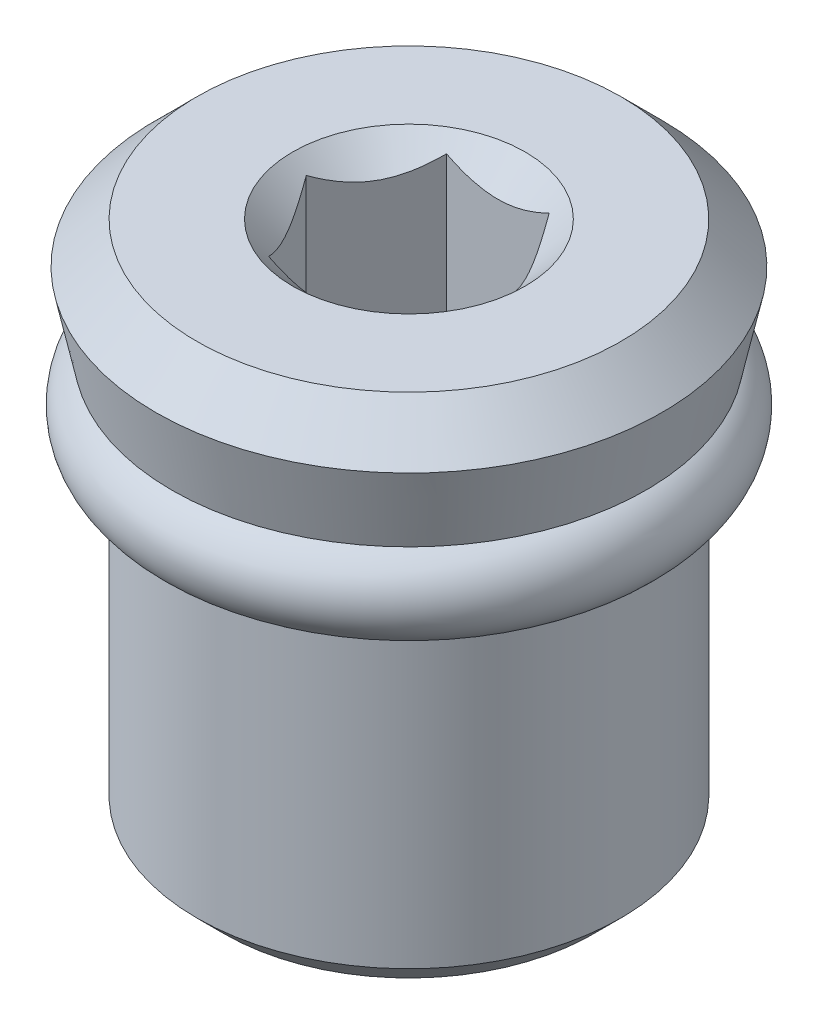
ISO-10303-21;
HEADER;
FILE_DESCRIPTION(('STEP AP214'),'2;1');
FILE_NAME('part.step','',(''),(''),'','','');
FILE_SCHEMA(('AUTOMOTIVE_DESIGN { 1 0 10303 214 1 1 1 1 }'));
ENDSEC;
DATA;
#1=APPLICATION_CONTEXT('core data for automotive mechanical design processes');
#2=APPLICATION_PROTOCOL_DEFINITION('international standard','automotive_design',2000,#1);
#3=PRODUCT_CONTEXT('',#1,'mechanical');
#4=PRODUCT('Part','Part','',(#3));
#5=PRODUCT_RELATED_PRODUCT_CATEGORY('part','',(#4));
#6=PRODUCT_DEFINITION_FORMATION('','',#4);
#7=PRODUCT_DEFINITION_CONTEXT('part definition',#1,'design');
#8=PRODUCT_DEFINITION('design','',#6,#7);
#9=PRODUCT_DEFINITION_SHAPE('','',#8);
#10=(LENGTH_UNIT() NAMED_UNIT(*) SI_UNIT(.MILLI.,.METRE.));
#11=(NAMED_UNIT(*) PLANE_ANGLE_UNIT() SI_UNIT($,.RADIAN.));
#12=(NAMED_UNIT(*) SI_UNIT($,.STERADIAN.) SOLID_ANGLE_UNIT());
#13=UNCERTAINTY_MEASURE_WITH_UNIT(LENGTH_MEASURE(1.E-05),#10,'distance_accuracy_value','');
#14=(GEOMETRIC_REPRESENTATION_CONTEXT(3) GLOBAL_UNCERTAINTY_ASSIGNED_CONTEXT((#13)) GLOBAL_UNIT_ASSIGNED_CONTEXT((#10,
#11,#12)) REPRESENTATION_CONTEXT('',''));
#15=CARTESIAN_POINT('',(0.,0.,0.));
#16=DIRECTION('',(0.,0.,1.));
#17=DIRECTION('',(1.,0.,0.));
#18=AXIS2_PLACEMENT_3D('',#15,#16,#17);
#19=CARTESIAN_POINT('',(0.,4.9022,0.));
#20=DIRECTION('',(0.,1.,0.));
#21=DIRECTION('',(0.,0.,1.));
#22=AXIS2_PLACEMENT_3D('',#19,#20,#21);
#23=PLANE('',#22);
#24=CARTESIAN_POINT('',(0.,4.9022,0.));
#25=DIRECTION('',(0.,-1.,0.));
#26=DIRECTION('',(0.,0.,-1.));
#27=AXIS2_PLACEMENT_3D('',#24,#25,#26);
#28=CIRCLE('',#27,1.524);
#29=CARTESIAN_POINT('',(0.,4.9022,-1.524));
#30=VERTEX_POINT('',#29);
#31=EDGE_CURVE('E84',#30,#30,#28,.F.);
#32=ORIENTED_EDGE('',*,*,#31,.T.);
#33=EDGE_LOOP('',(#32));
#34=FACE_BOUND('',#33,.T.);
#35=ADVANCED_FACE('F14',(#34),#23,.T.);
#36=CARTESIAN_POINT('',(0.,0.,0.));
#37=DIRECTION('',(0.,-1.,0.));
#38=DIRECTION('',(0.,0.,-1.));
#39=AXIS2_PLACEMENT_3D('',#36,#37,#38);
#40=CYLINDRICAL_SURFACE('',#39,1.524);
#41=CARTESIAN_POINT('',(0.,5.969,0.));
#42=DIRECTION('',(0.,-1.,0.));
#43=DIRECTION('',(0.,0.,-1.));
#44=AXIS2_PLACEMENT_3D('',#41,#42,#43);
#45=CIRCLE('',#44,1.524);
#46=CARTESIAN_POINT('',(0.,5.969,-1.524));
#47=VERTEX_POINT('',#46);
#48=EDGE_CURVE('E151',#47,#47,#45,.T.);
#49=ORIENTED_EDGE('',*,*,#48,.F.);
#50=EDGE_LOOP('',(#49));
#51=FACE_BOUND('',#50,.T.);
#52=ORIENTED_EDGE('',*,*,#31,.F.);
#53=EDGE_LOOP('',(#52));
#54=FACE_BOUND('',#53,.T.);
#55=ADVANCED_FACE('F164',(#51,#54),#40,.F.);
#56=CARTESIAN_POINT('',(0.953205294432182,9.779,-1.651));
#57=DIRECTION('',(0.,0.,-1.));
#58=DIRECTION('',(-1.,0.,0.));
#59=AXIS2_PLACEMENT_3D('',#56,#57,#58);
#60=PLANE('',#59);
#61=DIRECTION('',(1.,0.,0.));
#62=VECTOR('',#61,1.);
#63=CARTESIAN_POINT('',(0.,5.969,-1.651));
#64=LINE('',#63,#62);
#65=CARTESIAN_POINT('',(0.953205294432088,5.969,-1.65099999999995));
#66=VERTEX_POINT('',#65);
#67=CARTESIAN_POINT('',(-0.953205294432182,5.969,-1.651));
#68=VERTEX_POINT('',#67);
#69=EDGE_CURVE('E83',#66,#68,#64,.F.);
#70=ORIENTED_EDGE('',*,*,#69,.F.);
#71=DIRECTION('',(0.,1.,0.));
#72=VECTOR('',#71,1.);
#73=CARTESIAN_POINT('',(0.953205294432042,9.779,-1.65099999999992));
#74=LINE('',#73,#72);
#75=CARTESIAN_POINT('',(0.953205301512043,9.52641059237852,-1.65099999999996));
#76=VERTEX_POINT('',#75);
#77=EDGE_CURVE('E81',#66,#76,#74,.T.);
#78=ORIENTED_EDGE('',*,*,#77,.T.);
#79=CARTESIAN_POINT('',(-0.953205294437618,9.52641058884134,-1.651));
#80=CARTESIAN_POINT('',(-0.888109084456999,9.49389285365693,-1.651));
#81=CARTESIAN_POINT('',(-0.821931401391961,9.46327383361916,-1.651));
#82=CARTESIAN_POINT('',(-0.686963299015953,9.40714855144635,-1.651));
#83=CARTESIAN_POINT('',(-0.618158846328384,9.38167633531001,-1.651));
#84=CARTESIAN_POINT('',(-0.478561374437329,9.33769129266956,-1.651));
#85=CARTESIAN_POINT('',(-0.40777597887863,9.31915491338091,-1.651));
#86=CARTESIAN_POINT('',(-0.264653451925277,9.29061735614404,-1.651));
#87=CARTESIAN_POINT('',(-0.192321837851207,9.28058978435667,-1.651));
#88=CARTESIAN_POINT('',(-0.0997722099934443,9.2738911862383,-1.651));
#89=CARTESIAN_POINT('',(-0.0798277745381584,9.27280823251983,-1.651));
#90=CARTESIAN_POINT('',(-0.0399231576531303,9.27136250831862,-1.651));
#91=CARTESIAN_POINT('',(-0.0199629906792633,9.2709993466112,-1.651));
#92=CARTESIAN_POINT('',(0.050103182880875,9.2710016397877,-1.651));
#93=CARTESIAN_POINT('',(0.100224152602132,9.27329499197237,-1.651));
#94=CARTESIAN_POINT('',(0.200075175816755,9.28233219947409,-1.651));
#95=CARTESIAN_POINT('',(0.249804932157321,9.28907915891043,-1.651));
#96=CARTESIAN_POINT('',(0.398331442254182,9.31557865174664,-1.651));
#97=CARTESIAN_POINT('',(0.496045745586531,9.34158530495556,-1.651));
#98=CARTESIAN_POINT('',(0.65388667999256,9.39478821956724,-1.651));
#99=CARTESIAN_POINT('',(0.715299200312795,9.418445759385,-1.651));
#100=CARTESIAN_POINT('',(0.835798884363598,9.46971928130835,-1.651));
#101=CARTESIAN_POINT('',(0.894902179309705,9.49729707830055,-1.651));
#102=CARTESIAN_POINT('',(0.953205308592044,9.52641059591856,-1.651));
#103=B_SPLINE_CURVE_WITH_KNOTS('',3,(#79,#80,#81,#82,#83,#84,#85,#86,#87,#88,#89,#90,#91,#92,
#93,#94,#95,#96,#97,#98,#99,#100,#101,#102),.UNSPECIFIED.,.F.,.F.,(4,2,2,2,2,2,2,2,2,2,2,4),(0.,
0.218449092288305,0.438299044128636,0.657395501802324,0.87580982401266,0.935722271536715,
0.995602146230787,1.14588886232876,1.29628043751116,1.59830598785155,1.79561517029739,
1.99111966126824),.UNSPECIFIED.);
#104=CARTESIAN_POINT('',(-0.9532052944349,9.52641058883998,-1.651));
#105=VERTEX_POINT('',#104);
#106=EDGE_CURVE('E73',#105,#76,#103,.T.);
#107=ORIENTED_EDGE('',*,*,#106,.F.);
#108=DIRECTION('',(0.,1.,0.));
#109=VECTOR('',#108,1.);
#110=CARTESIAN_POINT('',(-0.953205294432182,9.779,-1.651));
#111=LINE('',#110,#109);
#112=EDGE_CURVE('E78',#105,#68,#111,.F.);
#113=ORIENTED_EDGE('',*,*,#112,.T.);
#114=EDGE_LOOP('',(#70,#78,#107,#113));
#115=FACE_BOUND('',#114,.T.);
#116=ADVANCED_FACE('F77',(#115),#60,.F.);
#117=CARTESIAN_POINT('',(0.,5.969,0.));
#118=DIRECTION('',(0.,1.,0.));
#119=DIRECTION('',(0.,0.,1.));
#120=AXIS2_PLACEMENT_3D('',#117,#118,#119);
#121=PLANE('',#120);
#122=ORIENTED_EDGE('',*,*,#48,.T.);
#123=EDGE_LOOP('',(#122));
#124=FACE_BOUND('',#123,.T.);
#125=DIRECTION('',(0.500000000000017,0.,0.866025403784429));
#126=VECTOR('',#125,1.);
#127=CARTESIAN_POINT('',(-1.90641058886411,5.969,0.));
#128=LINE('',#127,#126);
#129=CARTESIAN_POINT('',(-1.90641058886416,5.969,0.));
#130=VERTEX_POINT('',#129);
#131=CARTESIAN_POINT('',(-0.953205294432042,5.969,1.65099999999995));
#132=VERTEX_POINT('',#131);
#133=EDGE_CURVE('E237',#130,#132,#128,.T.);
#134=ORIENTED_EDGE('',*,*,#133,.T.);
#135=DIRECTION('',(1.,0.,0.));
#136=VECTOR('',#135,1.);
#137=CARTESIAN_POINT('',(-0.953205294432182,5.969,1.651));
#138=LINE('',#137,#136);
#139=CARTESIAN_POINT('',(0.953205294432182,5.969,1.651));
#140=VERTEX_POINT('',#139);
#141=EDGE_CURVE('E150',#132,#140,#138,.T.);
#142=ORIENTED_EDGE('',*,*,#141,.T.);
#143=DIRECTION('',(0.500000000000017,0.,-0.866025403784429));
#144=VECTOR('',#143,1.);
#145=CARTESIAN_POINT('',(0.953205294432182,5.969,1.651));
#146=LINE('',#145,#144);
#147=CARTESIAN_POINT('',(1.90641058886416,5.969,0.));
#148=VERTEX_POINT('',#147);
#149=EDGE_CURVE('E253',#140,#148,#146,.T.);
#150=ORIENTED_EDGE('',*,*,#149,.T.);
#151=DIRECTION('',(-0.500000000000017,0.,-0.866025403784429));
#152=VECTOR('',#151,1.);
#153=CARTESIAN_POINT('',(1.90641058886411,5.969,0.));
#154=LINE('',#153,#152);
#155=EDGE_CURVE('E247',#148,#66,#154,.T.);
#156=ORIENTED_EDGE('',*,*,#155,.T.);
#157=ORIENTED_EDGE('',*,*,#69,.T.);
#158=DIRECTION('',(-0.500000000000017,0.,0.866025403784429));
#159=VECTOR('',#158,1.);
#160=CARTESIAN_POINT('',(-0.953205294432182,5.969,-1.651));
#161=LINE('',#160,#159);
#162=EDGE_CURVE('E92',#68,#130,#161,.T.);
#163=ORIENTED_EDGE('',*,*,#162,.T.);
#164=EDGE_LOOP('',(#134,#142,#150,#156,#157,#163));
#165=FACE_BOUND('',#164,.T.);
#166=ADVANCED_FACE('F157',(#124,#165),#121,.T.);
#167=CARTESIAN_POINT('',(-0.953205294432182,9.779,1.651));
#168=DIRECTION('',(0.,0.,1.));
#169=DIRECTION('',(1.,0.,0.));
#170=AXIS2_PLACEMENT_3D('',#167,#168,#169);
#171=PLANE('',#170);
#172=DIRECTION('',(0.,1.,0.));
#173=VECTOR('',#172,1.);
#174=CARTESIAN_POINT('',(0.953205294432182,9.779,1.651));
#175=LINE('',#174,#173);
#176=CARTESIAN_POINT('',(0.9532052944349,9.52641058883998,1.651));
#177=VERTEX_POINT('',#176);
#178=EDGE_CURVE('E149',#177,#140,#175,.F.);
#179=ORIENTED_EDGE('',*,*,#178,.T.);
#180=ORIENTED_EDGE('',*,*,#141,.F.);
#181=DIRECTION('',(0.,1.,0.));
#182=VECTOR('',#181,1.);
#183=CARTESIAN_POINT('',(-0.953205294432042,9.779,1.65099999999992));
#184=LINE('',#183,#182);
#185=CARTESIAN_POINT('',(-0.953205301506027,9.52641059237551,1.65099999999996));
#186=VERTEX_POINT('',#185);
#187=EDGE_CURVE('E234',#132,#186,#184,.T.);
#188=ORIENTED_EDGE('',*,*,#187,.T.);
#189=CARTESIAN_POINT('',(0.953205294437618,9.52641058884134,1.651));
#190=CARTESIAN_POINT('',(0.888109084456995,9.49389285365693,1.651));
#191=CARTESIAN_POINT('',(0.821931401391954,9.46327383361916,1.651));
#192=CARTESIAN_POINT('',(0.686963299015939,9.40714855144634,1.651));
#193=CARTESIAN_POINT('',(0.618158846328366,9.38167633531001,1.651));
#194=CARTESIAN_POINT('',(0.47856137443731,9.33769129266955,1.651));
#195=CARTESIAN_POINT('',(0.407775978878615,9.31915491338091,1.651));
#196=CARTESIAN_POINT('',(0.264653451925269,9.29061735614404,1.651));
#197=CARTESIAN_POINT('',(0.192321837851203,9.28058978435667,1.651));
#198=CARTESIAN_POINT('',(0.0997722099934444,9.2738911862383,1.651));
#199=CARTESIAN_POINT('',(0.0798277745381588,9.27280823251983,1.651));
#200=CARTESIAN_POINT('',(0.0399231576531307,9.27136250831862,1.651));
#201=CARTESIAN_POINT('',(0.0199629906792634,9.2709993466112,1.651));
#202=CARTESIAN_POINT('',(-0.0501031828808779,9.27100163978771,1.651));
#203=CARTESIAN_POINT('',(-0.100224152602137,9.27329499197237,1.651));
#204=CARTESIAN_POINT('',(-0.200075175816766,9.28233219947409,1.651));
#205=CARTESIAN_POINT('',(-0.249804932157335,9.28907915891043,1.651));
#206=CARTESIAN_POINT('',(-0.398331442254193,9.31557865174664,1.651));
#207=CARTESIAN_POINT('',(-0.496045745586538,9.34158530495557,1.651));
#208=CARTESIAN_POINT('',(-0.653886679990415,9.39478821956652,1.651));
#209=CARTESIAN_POINT('',(-0.715299200308569,9.41844575938337,1.651));
#210=CARTESIAN_POINT('',(-0.835798884355367,9.46971928130468,1.651));
#211=CARTESIAN_POINT('',(-0.894902179299548,9.49729707829574,1.651));
#212=CARTESIAN_POINT('',(-0.953205308580012,9.52641059591254,1.651));
#213=B_SPLINE_CURVE_WITH_KNOTS('',3,(#189,#190,#191,#192,#193,#194,#195,#196,#197,#198,#199,
#200,#201,#202,#203,#204,#205,#206,#207,#208,#209,#210,#211,#212),.UNSPECIFIED.,.F.,.F.,(4,2,2,
2,2,2,2,2,2,2,2,4),(0.,0.218449092288317,0.438299044128661,0.657395501802337,0.87580982401266,
0.935722271536715,0.995602146230787,1.14588886232877,1.29628043751118,1.59830598785155,
1.7956151702906,1.99111966125479),.UNSPECIFIED.);
#214=EDGE_CURVE('E144',#177,#186,#213,.T.);
#215=ORIENTED_EDGE('',*,*,#214,.F.);
#216=EDGE_LOOP('',(#179,#180,#188,#215));
#217=FACE_BOUND('',#216,.T.);
#218=ADVANCED_FACE('F152',(#217),#171,.F.);
#219=CARTESIAN_POINT('',(0.953205294432182,9.779,1.651));
#220=DIRECTION('',(0.866025403784429,0.,0.500000000000017));
#221=DIRECTION('',(0.500000000000017,0.,-0.866025403784429));
#222=AXIS2_PLACEMENT_3D('',#219,#220,#221);
#223=PLANE('',#222);
#224=ORIENTED_EDGE('',*,*,#149,.F.);
#225=ORIENTED_EDGE('',*,*,#178,.F.);
#226=CARTESIAN_POINT('',(0.953205294429464,9.52641058884134,1.65100000000471));
#227=CARTESIAN_POINT('',(0.985967425871133,9.49367989852208,1.59425432378349));
#228=CARTESIAN_POINT('',(1.01927734085568,9.4628718541863,1.53655985863445));
#229=CARTESIAN_POINT('',(1.08719967584676,9.40646364020631,1.41891492346119));
#230=CARTESIAN_POINT('',(1.12181855174134,9.38089484581812,1.35895327151087));
#231=CARTESIAN_POINT('',(1.19162581689066,9.33709532887497,1.23804354153481));
#232=CARTESIAN_POINT('',(1.22679643792499,9.31875454761296,1.17712623896961));
#233=CARTESIAN_POINT('',(1.29791174638021,9.29049708106321,1.05395091152924));
#234=CARTESIAN_POINT('',(1.33385426289185,9.28055931055145,0.991696646779193));
#235=CARTESIAN_POINT('',(1.39580284506867,9.27159264037126,0.884398554992093));
#236=CARTESIAN_POINT('',(1.42172893517602,9.27026568345192,0.839493249684555));
#237=CARTESIAN_POINT('',(1.47353869833322,9.27250409216762,0.749756107568187));
#238=CARTESIAN_POINT('',(1.49942235333234,9.27607117260535,0.704924302024133));
#239=CARTESIAN_POINT('',(1.55093868854157,9.28789315556536,0.615695392021996));
#240=CARTESIAN_POINT('',(1.5765711320739,9.29615211383214,0.57129869750186));
#241=CARTESIAN_POINT('',(1.62740577841162,9.31690911670066,0.483250507260133));
#242=CARTESIAN_POINT('',(1.65260779173613,9.32940898013023,0.439599339729062));
#243=CARTESIAN_POINT('',(1.7171357021499,9.36650417028996,0.327833720386167));
#244=CARTESIAN_POINT('',(1.75606206429161,9.3938913958434,0.260411283402905));
#245=CARTESIAN_POINT('',(1.81329900310096,9.44012241006832,0.161273997315396));
#246=CARTESIAN_POINT('',(1.83216035147617,9.45636486133099,0.128605183630273));
#247=CARTESIAN_POINT('',(1.8695363645536,9.4903323894169,0.0638680299958173));
#248=CARTESIAN_POINT('',(1.88805118914382,9.50805676074826,0.031799413112331));
#249=CARTESIAN_POINT('',(1.90641055351975,9.52641055349418,6.12185469671671E-08));
#250=B_SPLINE_CURVE_WITH_KNOTS('',3,(#226,#227,#228,#229,#230,#231,#232,#233,#234,#235,#236,
#237,#238,#239,#240,#241,#242,#243,#244,#245,#246,#247,#248,#249),.UNSPECIFIED.,.F.,.F.,(4,2,2,
2,2,2,2,2,2,2,2,4),(0.,0.21988504460397,0.44105068455983,0.658704962374007,0.875811457438176,
1.03119868902858,1.18664038005255,1.34221664259965,1.49785971279148,1.74492986295728,
1.86812146247109,1.99125474498179),.UNSPECIFIED.);
#251=CARTESIAN_POINT('',(1.90641057119196,9.52641057116638,3.06092228777414E-08));
#252=VERTEX_POINT('',#251);
#253=EDGE_CURVE('E103',#177,#252,#250,.T.);
#254=ORIENTED_EDGE('',*,*,#253,.T.);
#255=DIRECTION('',(0.,1.,0.));
#256=VECTOR('',#255,1.);
#257=CARTESIAN_POINT('',(1.90641058886411,9.779,0.));
#258=LINE('',#257,#256);
#259=EDGE_CURVE('E250',#252,#148,#258,.F.);
#260=ORIENTED_EDGE('',*,*,#259,.T.);
#261=EDGE_LOOP('',(#224,#225,#254,#260));
#262=FACE_BOUND('',#261,.T.);
#263=ADVANCED_FACE('F156',(#262),#223,.F.);
#264=CARTESIAN_POINT('',(1.90641058886411,9.779,0.));
#265=DIRECTION('',(0.866025403784429,0.,-0.500000000000017));
#266=DIRECTION('',(-0.500000000000017,0.,-0.866025403784429));
#267=AXIS2_PLACEMENT_3D('',#264,#265,#266);
#268=PLANE('',#267);
#269=ORIENTED_EDGE('',*,*,#155,.F.);
#270=ORIENTED_EDGE('',*,*,#259,.F.);
#271=CARTESIAN_POINT('',(1.90641059594165,9.52641059591608,1.22586678472982E-08));
#272=CARTESIAN_POINT('',(1.87364846407954,9.49367990481532,-0.0567456646907771));
#273=CARTESIAN_POINT('',(1.84033854866334,9.46287185971037,-0.114440130587455));
#274=CARTESIAN_POINT('',(1.77241621276724,9.40646364426125,-0.232085067328269));
#275=CARTESIAN_POINT('',(1.73779733639883,9.38089484917494,-0.292046720099298));
#276=CARTESIAN_POINT('',(1.6679900702768,9.33709533099221,-0.412956451760119));
#277=CARTESIAN_POINT('',(1.63281944874445,9.31875454918516,-0.473873755187923));
#278=CARTESIAN_POINT('',(1.56170413926118,9.29049708176433,-0.597049084408924));
#279=CARTESIAN_POINT('',(1.52576162221971,9.28055931092505,-0.65930335007667));
#280=CARTESIAN_POINT('',(1.46381303948397,9.27159264047323,-0.766601442831843));
#281=CARTESIAN_POINT('',(1.43788694935386,9.27026568347425,-0.811506748178809));
#282=CARTESIAN_POINT('',(1.38607718614728,9.27250409204057,-0.90124389038071));
#283=CARTESIAN_POINT('',(1.36019353112154,9.2760711724086,-0.94607569597087));
#284=CARTESIAN_POINT('',(1.30867719585991,9.28789315524237,-1.03530460606377));
#285=CARTESIAN_POINT('',(1.28304475230176,9.29615211345202,-1.07970130062862));
#286=CARTESIAN_POINT('',(1.2322101059113,9.3169091162204,-1.16774949096169));
#287=CARTESIAN_POINT('',(1.20700809255988,9.32940897960696,-1.21140065853938));
#288=CARTESIAN_POINT('',(1.14248018194902,9.3665041697464,-1.32316627822365));
#289=CARTESIAN_POINT('',(1.1035538196414,9.39389139536276,-1.39058871549427));
#290=CARTESIAN_POINT('',(1.04631688058926,9.44012240973304,-1.48972600200229));
#291=CARTESIAN_POINT('',(1.02745553213252,9.45636486105432,-1.52239481582864));
#292=CARTESIAN_POINT('',(0.990079518895192,9.49033238927074,-1.58713196974005));
#293=CARTESIAN_POINT('',(0.971564694226603,9.50805676067396,-1.61920058675927));
#294=CARTESIAN_POINT('',(0.953205329773573,9.52641055349695,-1.65099993878659));
#295=B_SPLINE_CURVE_WITH_KNOTS('',3,(#271,#272,#273,#274,#275,#276,#277,#278,#279,#280,#281,
#282,#283,#284,#285,#286,#287,#288,#289,#290,#291,#292,#293,#294),.UNSPECIFIED.,.F.,.F.,(4,2,2,
2,2,2,2,2,2,2,2,4),(0.,0.219885047915711,0.441050691258572,0.658704972363254,0.875811470685046,
1.03119870241807,1.18664039358598,1.34221665625777,1.49785972657449,1.74492987773388,
1.8681214777663,1.99125476079389),.UNSPECIFIED.);
#296=EDGE_CURVE('E99',#252,#76,#295,.T.);
#297=ORIENTED_EDGE('',*,*,#296,.T.);
#298=ORIENTED_EDGE('',*,*,#77,.F.);
#299=EDGE_LOOP('',(#269,#270,#297,#298));
#300=FACE_BOUND('',#299,.T.);
#301=ADVANCED_FACE('F383',(#300),#268,.F.);
#302=CARTESIAN_POINT('',(-0.953205294432182,9.779,-1.651));
#303=DIRECTION('',(-0.866025403784429,0.,-0.500000000000017));
#304=DIRECTION('',(-0.500000000000017,0.,0.866025403784429));
#305=AXIS2_PLACEMENT_3D('',#302,#303,#304);
#306=PLANE('',#305);
#307=ORIENTED_EDGE('',*,*,#162,.F.);
#308=ORIENTED_EDGE('',*,*,#112,.F.);
#309=CARTESIAN_POINT('',(-0.953205294429464,9.52641058884134,-1.65100000000471));
#310=CARTESIAN_POINT('',(-0.985967425871133,9.49367989852208,-1.59425432378349));
#311=CARTESIAN_POINT('',(-1.01927734085568,9.46287185418631,-1.53655985863446));
#312=CARTESIAN_POINT('',(-1.08719967584676,9.40646364020631,-1.41891492346119));
#313=CARTESIAN_POINT('',(-1.12181855174133,9.38089484581812,-1.35895327151088));
#314=CARTESIAN_POINT('',(-1.19162581689066,9.33709532887497,-1.23804354153482));
#315=CARTESIAN_POINT('',(-1.22679643792499,9.31875454761296,-1.17712623896962));
#316=CARTESIAN_POINT('',(-1.29791174638021,9.29049708106321,-1.05395091152924));
#317=CARTESIAN_POINT('',(-1.33385426289185,9.28055931055145,-0.991696646779194));
#318=CARTESIAN_POINT('',(-1.39580284506867,9.27159264037126,-0.884398554992092));
#319=CARTESIAN_POINT('',(-1.42172893517602,9.27026568345192,-0.839493249684554));
#320=CARTESIAN_POINT('',(-1.47353869833322,9.27250409216762,-0.749756107568186));
#321=CARTESIAN_POINT('',(-1.49942235333234,9.27607117260535,-0.704924302024131));
#322=CARTESIAN_POINT('',(-1.55093868854157,9.28789315556536,-0.615695392021994));
#323=CARTESIAN_POINT('',(-1.5765711320739,9.29615211383214,-0.571298697501858));
#324=CARTESIAN_POINT('',(-1.62740577841162,9.31690911670066,-0.483250507260132));
#325=CARTESIAN_POINT('',(-1.65260779173613,9.32940898013023,-0.439599339729062));
#326=CARTESIAN_POINT('',(-1.71713570214981,9.36650417028991,-0.327833720386323));
#327=CARTESIAN_POINT('',(-1.75606206429143,9.39389139584327,-0.260411283403212));
#328=CARTESIAN_POINT('',(-1.81329900310066,9.44012241006807,-0.16127399731592));
#329=CARTESIAN_POINT('',(-1.83216035147583,9.45636486133069,-0.128605183630868));
#330=CARTESIAN_POINT('',(-1.86953636455318,9.49033238941651,-0.0638680299965507));
#331=CARTESIAN_POINT('',(-1.88805118914336,9.50805676074781,-0.0317994131131322));
#332=CARTESIAN_POINT('',(-1.90641055351925,9.52641055349368,-6.12194148404725E-08));
#333=B_SPLINE_CURVE_WITH_KNOTS('',3,(#309,#310,#311,#312,#313,#314,#315,#316,#317,#318,#319,
#320,#321,#322,#323,#324,#325,#326,#327,#328,#329,#330,#331,#332),.UNSPECIFIED.,.F.,.F.,(4,2,2,
2,2,2,2,2,2,2,2,4),(0.,0.219885044603966,0.441050684559824,0.658704962374004,0.875811457438177,
1.03119868902858,1.18664038005255,1.34221664259965,1.49785971279148,1.74492986295672,
1.86812146247025,1.99125474498067),.UNSPECIFIED.);
#334=CARTESIAN_POINT('',(-1.9064105711917,9.52641057116613,-3.06096699025098E-08));
#335=VERTEX_POINT('',#334);
#336=EDGE_CURVE('E90',#105,#335,#333,.T.);
#337=ORIENTED_EDGE('',*,*,#336,.T.);
#338=DIRECTION('',(0.,1.,0.));
#339=VECTOR('',#338,1.);
#340=CARTESIAN_POINT('',(-1.90641058886411,9.779,0.));
#341=LINE('',#340,#339);
#342=EDGE_CURVE('E240',#335,#130,#341,.F.);
#343=ORIENTED_EDGE('',*,*,#342,.T.);
#344=EDGE_LOOP('',(#307,#308,#337,#343));
#345=FACE_BOUND('',#344,.T.);
#346=ADVANCED_FACE('F88',(#345),#306,.F.);
#347=CARTESIAN_POINT('',(-1.90641058886411,9.779,0.));
#348=DIRECTION('',(-0.866025403784429,0.,0.500000000000017));
#349=DIRECTION('',(0.500000000000017,0.,0.866025403784429));
#350=AXIS2_PLACEMENT_3D('',#347,#348,#349);
#351=PLANE('',#350);
#352=ORIENTED_EDGE('',*,*,#133,.F.);
#353=ORIENTED_EDGE('',*,*,#342,.F.);
#354=CARTESIAN_POINT('',(-1.90641059594217,9.5264105959166,-1.22595618285292E-08));
#355=CARTESIAN_POINT('',(-1.87364846408005,9.49367990481579,0.0567456646899046));
#356=CARTESIAN_POINT('',(-1.84033854866383,9.46287185971081,0.114440130586604));
#357=CARTESIAN_POINT('',(-1.7724162127677,9.4064636442616,0.232085067327465));
#358=CARTESIAN_POINT('',(-1.73779733639927,9.38089484917526,0.292046720098519));
#359=CARTESIAN_POINT('',(-1.66799007027718,9.33709533099241,0.41295645175946));
#360=CARTESIAN_POINT('',(-1.63281944874478,9.31875454918532,0.473873755187359));
#361=CARTESIAN_POINT('',(-1.56170413926139,9.2904970817644,0.597049084408558));
#362=CARTESIAN_POINT('',(-1.52576162221986,9.28055931092507,0.659303350076407));
#363=CARTESIAN_POINT('',(-1.46381303948405,9.27159264047324,0.766601442831698));
#364=CARTESIAN_POINT('',(-1.43788694935393,9.27026568347426,0.811506748178679));
#365=CARTESIAN_POINT('',(-1.38607718614734,9.27250409204057,0.901243890380611));
#366=CARTESIAN_POINT('',(-1.36019353112159,9.27607117240859,0.946075695970787));
#367=CARTESIAN_POINT('',(-1.30867719585995,9.28789315524236,1.03530460606369));
#368=CARTESIAN_POINT('',(-1.28304475230181,9.296152113452,1.07970130062854));
#369=CARTESIAN_POINT('',(-1.23221010591136,9.31690911622037,1.16774949096158));
#370=CARTESIAN_POINT('',(-1.20700809255994,9.32940897960693,1.21140065853927));
#371=CARTESIAN_POINT('',(-1.14248018195291,9.36650416974416,1.32316627821691));
#372=CARTESIAN_POINT('',(-1.10355381964898,9.39389139535743,1.39058871548114));
#373=CARTESIAN_POINT('',(-1.04631688060216,9.44012240972224,1.48972600197995));
#374=CARTESIAN_POINT('',(-1.02745553214714,9.45636486104155,1.5223948158033));
#375=CARTESIAN_POINT('',(-0.990079518913213,9.49033238925384,1.58713196970883));
#376=CARTESIAN_POINT('',(-0.971564694246288,9.50805676065489,1.61920058672517));
#377=CARTESIAN_POINT('',(-0.953205329794898,9.52641055347563,1.65099993874965));
#378=B_SPLINE_CURVE_WITH_KNOTS('',3,(#354,#355,#356,#357,#358,#359,#360,#361,#362,#363,#364,
#365,#366,#367,#368,#369,#370,#371,#372,#373,#374,#375,#376,#377),.UNSPECIFIED.,.F.,.F.,(4,2,2,
2,2,2,2,2,2,2,2,4),(0.,0.219885047915829,0.441050691258818,0.658704972363861,0.875811470686014,
1.03119870241909,1.18664039358706,1.34221665625882,1.49785972657549,1.74492987771105,
1.86812147773162,1.99125476074739),.UNSPECIFIED.);
#379=EDGE_CURVE('E98',#335,#186,#378,.T.);
#380=ORIENTED_EDGE('',*,*,#379,.T.);
#381=ORIENTED_EDGE('',*,*,#187,.F.);
#382=EDGE_LOOP('',(#352,#353,#380,#381));
#383=FACE_BOUND('',#382,.T.);
#384=ADVANCED_FACE('F125',(#383),#351,.F.);
#385=CARTESIAN_POINT('',(0.,9.7789999999236,0.));
#386=DIRECTION('',(0.,1.,0.));
#387=DIRECTION('',(0.,0.,1.));
#388=AXIS2_PLACEMENT_3D('',#385,#386,#387);
#389=CONICAL_SURFACE('',#388,2.15899999994917,0.785398163397448);
#390=ORIENTED_EDGE('',*,*,#336,.F.);
#391=ORIENTED_EDGE('',*,*,#106,.T.);
#392=ORIENTED_EDGE('',*,*,#296,.F.);
#393=ORIENTED_EDGE('',*,*,#253,.F.);
#394=ORIENTED_EDGE('',*,*,#214,.T.);
#395=ORIENTED_EDGE('',*,*,#379,.F.);
#396=EDGE_LOOP('',(#390,#391,#392,#393,#394,#395));
#397=FACE_BOUND('',#396,.T.);
#398=CARTESIAN_POINT('',(0.,9.77899999998044,0.));
#399=DIRECTION('',(0.,1.,0.));
#400=DIRECTION('',(0.,0.,1.));
#401=AXIS2_PLACEMENT_3D('',#398,#399,#400);
#402=CIRCLE('',#401,2.15900000000602);
#403=CARTESIAN_POINT('',(0.,9.77899999998044,2.15900000000602));
#404=VERTEX_POINT('',#403);
#405=EDGE_CURVE('E101',#404,#404,#402,.F.);
#406=ORIENTED_EDGE('',*,*,#405,.F.);
#407=EDGE_LOOP('',(#406));
#408=FACE_BOUND('',#407,.T.);
#409=ADVANCED_FACE('F95',(#397,#408),#389,.F.);
#410=CARTESIAN_POINT('',(0.,9.779,0.));
#411=DIRECTION('',(0.,1.,0.));
#412=DIRECTION('',(0.,0.,1.));
#413=AXIS2_PLACEMENT_3D('',#410,#411,#412);
#414=PLANE('',#413);
#415=ORIENTED_EDGE('',*,*,#405,.T.);
#416=EDGE_LOOP('',(#415));
#417=FACE_BOUND('',#416,.T.);
#418=CARTESIAN_POINT('',(0.,9.77899999998044,0.));
#419=DIRECTION('',(0.,-1.,0.));
#420=DIRECTION('',(0.,0.,-1.));
#421=AXIS2_PLACEMENT_3D('',#418,#419,#420);
#422=CIRCLE('',#421,3.93700000006447);
#423=CARTESIAN_POINT('',(0.,9.77899999998044,-3.93700000006447));
#424=VERTEX_POINT('',#423);
#425=EDGE_CURVE('E289',#424,#424,#422,.T.);
#426=ORIENTED_EDGE('',*,*,#425,.F.);
#427=EDGE_LOOP('',(#426));
#428=FACE_BOUND('',#427,.T.);
#429=ADVANCED_FACE('F124',(#417,#428),#414,.T.);
#430=CARTESIAN_POINT('',(0.,0.127,0.));
#431=DIRECTION('',(0.,1.,0.));
#432=DIRECTION('',(0.,0.,1.));
#433=AXIS2_PLACEMENT_3D('',#430,#431,#432);
#434=PLANE('',#433);
#435=CARTESIAN_POINT('',(0.,0.127,0.));
#436=DIRECTION('',(0.,-1.,0.));
#437=DIRECTION('',(0.,0.,-1.));
#438=AXIS2_PLACEMENT_3D('',#435,#436,#437);
#439=CIRCLE('',#438,1.524);
#440=CARTESIAN_POINT('',(0.,0.127,-1.524));
#441=VERTEX_POINT('',#440);
#442=EDGE_CURVE('E233',#441,#441,#439,.T.);
#443=ORIENTED_EDGE('',*,*,#442,.T.);
#444=EDGE_LOOP('',(#443));
#445=FACE_BOUND('',#444,.T.);
#446=ADVANCED_FACE('F296',(#445),#434,.F.);
#447=CARTESIAN_POINT('',(0.,9.01700000008532,0.));
#448=DIRECTION('',(0.,-1.,0.));
#449=DIRECTION('',(0.,0.,-1.));
#450=AXIS2_PLACEMENT_3D('',#447,#448,#449);
#451=CONICAL_SURFACE('',#450,4.6989999999596,0.785398163397448);
#452=CARTESIAN_POINT('',(0.,9.01700000002847,0.));
#453=DIRECTION('',(0.,1.,0.));
#454=DIRECTION('',(0.,0.,-1.));
#455=AXIS2_PLACEMENT_3D('',#452,#453,#454);
#456=CIRCLE('',#455,4.69900000000223);
#457=CARTESIAN_POINT('',(0.,9.01700000002847,-4.69900000000223));
#458=VERTEX_POINT('',#457);
#459=EDGE_CURVE('E229',#458,#458,#456,.F.);
#460=ORIENTED_EDGE('',*,*,#459,.F.);
#461=EDGE_LOOP('',(#460));
#462=FACE_BOUND('',#461,.T.);
#463=ORIENTED_EDGE('',*,*,#425,.T.);
#464=EDGE_LOOP('',(#463));
#465=FACE_BOUND('',#464,.T.);
#466=ADVANCED_FACE('F299',(#462,#465),#451,.T.);
#467=CARTESIAN_POINT('',(0.,0.,0.));
#468=DIRECTION('',(0.,-1.,0.));
#469=DIRECTION('',(0.,0.,-1.));
#470=AXIS2_PLACEMENT_3D('',#467,#468,#469);
#471=CYLINDRICAL_SURFACE('',#470,1.524);
#472=CARTESIAN_POINT('',(0.,0.,0.));
#473=DIRECTION('',(0.,-1.,0.));
#474=DIRECTION('',(0.,0.,-1.));
#475=AXIS2_PLACEMENT_3D('',#472,#473,#474);
#476=CIRCLE('',#475,1.524);
#477=CARTESIAN_POINT('',(0.,0.,-1.524));
#478=VERTEX_POINT('',#477);
#479=EDGE_CURVE('E232',#478,#478,#476,.T.);
#480=ORIENTED_EDGE('',*,*,#479,.T.);
#481=EDGE_LOOP('',(#480));
#482=FACE_BOUND('',#481,.T.);
#483=ORIENTED_EDGE('',*,*,#442,.F.);
#484=EDGE_LOOP('',(#483));
#485=FACE_BOUND('',#484,.T.);
#486=ADVANCED_FACE('F301',(#482,#485),#471,.F.);
#487=CARTESIAN_POINT('',(0.,9.01699999997163,0.));
#488=DIRECTION('',(0.,1.,0.));
#489=DIRECTION('',(0.,0.,1.));
#490=AXIS2_PLACEMENT_3D('',#487,#488,#489);
#491=CONICAL_SURFACE('',#490,4.69899999998802,0.209439510240367);
#492=ORIENTED_EDGE('',*,*,#459,.T.);
#493=EDGE_LOOP('',(#492));
#494=FACE_BOUND('',#493,.T.);
#495=CARTESIAN_POINT('',(0.,7.61999999997443,0.));
#496=DIRECTION('',(0.,1.,0.));
#497=DIRECTION('',(0.,0.,1.));
#498=AXIS2_PLACEMENT_3D('',#495,#496,#497);
#499=CIRCLE('',#498,4.40205848333406);
#500=CARTESIAN_POINT('',(0.,7.61999999997443,4.40205848333406));
#501=VERTEX_POINT('',#500);
#502=EDGE_CURVE('E282',#501,#501,#499,.T.);
#503=ORIENTED_EDGE('',*,*,#502,.T.);
#504=EDGE_LOOP('',(#503));
#505=FACE_BOUND('',#504,.T.);
#506=ADVANCED_FACE('F308',(#494,#505),#491,.T.);
#507=CARTESIAN_POINT('',(0.,0.,0.));
#508=DIRECTION('',(0.,1.,0.));
#509=DIRECTION('',(0.,0.,1.));
#510=AXIS2_PLACEMENT_3D('',#507,#508,#509);
#511=PLANE('',#510);
#512=ORIENTED_EDGE('',*,*,#479,.F.);
#513=EDGE_LOOP('',(#512));
#514=FACE_BOUND('',#513,.T.);
#515=CARTESIAN_POINT('',(0.,0.,0.));
#516=DIRECTION('',(0.,1.,0.));
#517=DIRECTION('',(0.,0.,1.));
#518=AXIS2_PLACEMENT_3D('',#515,#516,#517);
#519=CIRCLE('',#518,3.42900000003965);
#520=CARTESIAN_POINT('',(0.,0.,3.42900000003965));
#521=VERTEX_POINT('',#520);
#522=EDGE_CURVE('E279',#521,#521,#519,.T.);
#523=ORIENTED_EDGE('',*,*,#522,.F.);
#524=EDGE_LOOP('',(#523));
#525=FACE_BOUND('',#524,.T.);
#526=ADVANCED_FACE('F207',(#514,#525),#511,.F.);
#527=CARTESIAN_POINT('',(0.,7.62,0.));
#528=DIRECTION('',(0.,1.,0.));
#529=DIRECTION('',(0.,0.,1.));
#530=AXIS2_PLACEMENT_3D('',#527,#528,#529);
#531=PLANE('',#530);
#532=CARTESIAN_POINT('',(0.,7.62,0.));
#533=DIRECTION('',(0.,-1.,0.));
#534=DIRECTION('',(0.,0.,1.));
#535=AXIS2_PLACEMENT_3D('',#532,#533,#534);
#536=CIRCLE('',#535,3.937);
#537=CARTESIAN_POINT('',(0.,7.62,3.937));
#538=VERTEX_POINT('',#537);
#539=CARTESIAN_POINT('',(0.,7.62,-3.937));
#540=VERTEX_POINT('',#539);
#541=EDGE_CURVE('E33',#538,#540,#536,.T.);
#542=ORIENTED_EDGE('',*,*,#541,.F.);
#543=CARTESIAN_POINT('',(0.,7.62,0.));
#544=DIRECTION('',(0.,-1.,0.));
#545=DIRECTION('',(0.,0.,-1.));
#546=AXIS2_PLACEMENT_3D('',#543,#544,#545);
#547=CIRCLE('',#546,3.937);
#548=EDGE_CURVE('E219',#540,#538,#547,.T.);
#549=ORIENTED_EDGE('',*,*,#548,.F.);
#550=EDGE_LOOP('',(#542,#549));
#551=FACE_BOUND('',#550,.T.);
#552=ORIENTED_EDGE('',*,*,#502,.F.);
#553=EDGE_LOOP('',(#552));
#554=FACE_BOUND('',#553,.T.);
#555=ADVANCED_FACE('F198',(#551,#554),#531,.F.);
#556=CARTESIAN_POINT('',(0.,0.507999999967979,0.));
#557=DIRECTION('',(0.,1.,0.));
#558=DIRECTION('',(0.,0.,1.));
#559=AXIS2_PLACEMENT_3D('',#556,#557,#558);
#560=CONICAL_SURFACE('',#559,3.93700000000763,0.785398163397448);
#561=CARTESIAN_POINT('',(0.,0.508,0.));
#562=DIRECTION('',(0.,1.,0.));
#563=DIRECTION('',(0.,0.,1.));
#564=AXIS2_PLACEMENT_3D('',#561,#562,#563);
#565=CIRCLE('',#564,3.937);
#566=CARTESIAN_POINT('',(0.,0.508,3.937));
#567=VERTEX_POINT('',#566);
#568=EDGE_CURVE('E25',#567,#567,#565,.T.);
#569=ORIENTED_EDGE('',*,*,#568,.F.);
#570=EDGE_LOOP('',(#569));
#571=FACE_BOUND('',#570,.T.);
#572=ORIENTED_EDGE('',*,*,#522,.T.);
#573=EDGE_LOOP('',(#572));
#574=FACE_BOUND('',#573,.T.);
#575=ADVANCED_FACE('F182',(#571,#574),#560,.T.);
#576=CARTESIAN_POINT('',(0.,6.7945,0.));
#577=DIRECTION('',(0.,1.,0.));
#578=DIRECTION('',(0.,0.,-1.));
#579=AXIS2_PLACEMENT_3D('',#576,#577,#578);
#580=TOROIDAL_SURFACE('',#579,3.937,0.8255);
#581=CARTESIAN_POINT('',(0.,5.969,0.));
#582=DIRECTION('',(0.,1.,0.));
#583=DIRECTION('',(0.,0.,1.));
#584=AXIS2_PLACEMENT_3D('',#581,#582,#583);
#585=CIRCLE('',#584,3.937);
#586=CARTESIAN_POINT('',(0.,5.969,3.937));
#587=VERTEX_POINT('',#586);
#588=EDGE_CURVE('E9',#587,#587,#585,.F.);
#589=ORIENTED_EDGE('',*,*,#588,.F.);
#590=EDGE_LOOP('',(#589));
#591=FACE_BOUND('',#590,.T.);
#592=ORIENTED_EDGE('',*,*,#548,.T.);
#593=ORIENTED_EDGE('',*,*,#541,.T.);
#594=EDGE_LOOP('',(#592,#593));
#595=FACE_BOUND('',#594,.T.);
#596=ADVANCED_FACE('F176',(#591,#595),#580,.T.);
#597=CARTESIAN_POINT('',(0.,0.,0.));
#598=DIRECTION('',(0.,1.,0.));
#599=DIRECTION('',(0.,0.,1.));
#600=AXIS2_PLACEMENT_3D('',#597,#598,#599);
#601=CYLINDRICAL_SURFACE('',#600,3.937);
#602=ORIENTED_EDGE('',*,*,#568,.T.);
#603=EDGE_LOOP('',(#602));
#604=FACE_BOUND('',#603,.T.);
#605=ORIENTED_EDGE('',*,*,#588,.T.);
#606=EDGE_LOOP('',(#605));
#607=FACE_BOUND('',#606,.T.);
#608=ADVANCED_FACE('F174',(#604,#607),#601,.T.);
#609=CLOSED_SHELL('',(#35,#55,#116,#166,#218,#263,#301,#346,#384,#409,#429,#446,#466,#486,#506,
#526,#555,#575,#596,#608));
#610=MANIFOLD_SOLID_BREP('B1',#609);
#611=ADVANCED_BREP_SHAPE_REPRESENTATION('',(#18,#610),#14);
#612=SHAPE_DEFINITION_REPRESENTATION(#9,#611);
ENDSEC;
END-ISO-10303-21;
